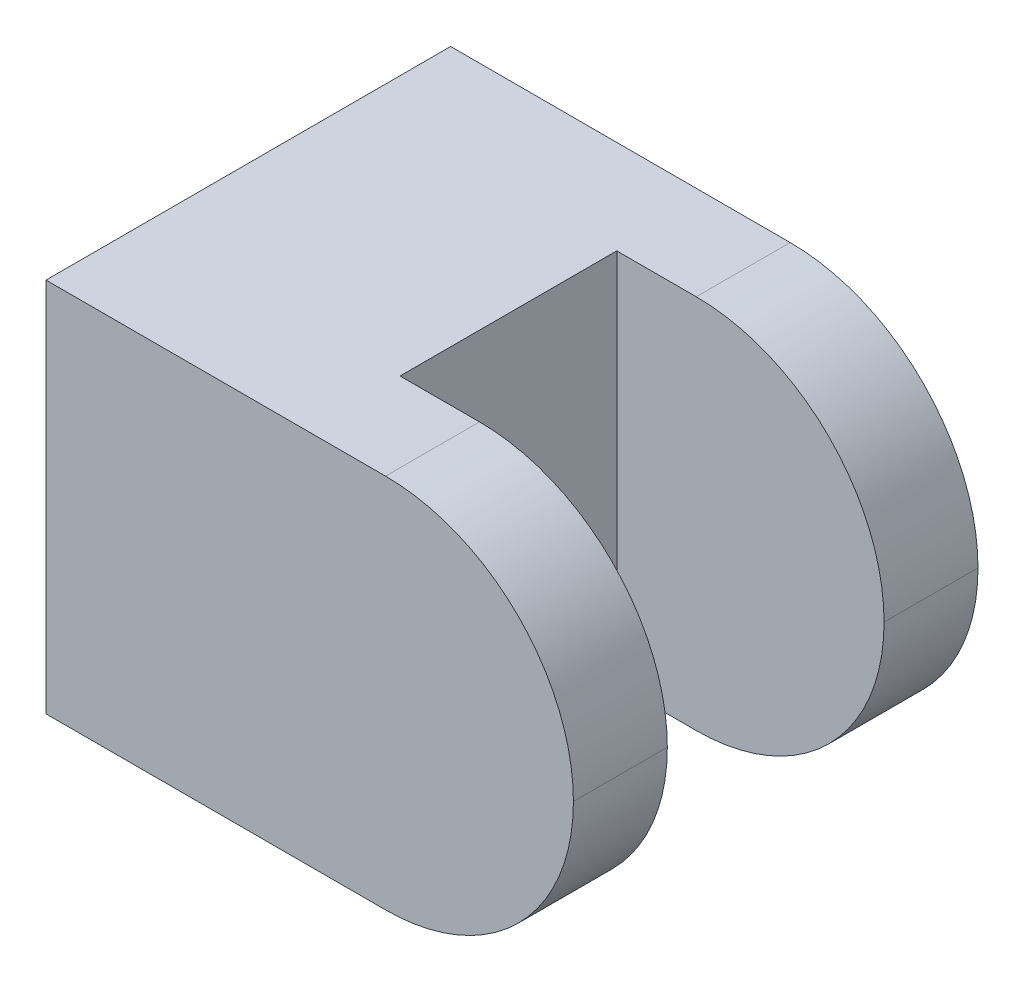
ISO-10303-21;
HEADER;
FILE_DESCRIPTION(('STEP AP214'),'2;1');
FILE_NAME('part.step','',(''),(''),'','','');
FILE_SCHEMA(('AUTOMOTIVE_DESIGN { 1 0 10303 214 1 1 1 1 }'));
ENDSEC;
DATA;
#1=APPLICATION_CONTEXT('core data for automotive mechanical design processes');
#2=APPLICATION_PROTOCOL_DEFINITION('international standard','automotive_design',2000,#1);
#3=PRODUCT_CONTEXT('',#1,'mechanical');
#4=PRODUCT('Part','Part','',(#3));
#5=PRODUCT_RELATED_PRODUCT_CATEGORY('part','',(#4));
#6=PRODUCT_DEFINITION_FORMATION('','',#4);
#7=PRODUCT_DEFINITION_CONTEXT('part definition',#1,'design');
#8=PRODUCT_DEFINITION('design','',#6,#7);
#9=PRODUCT_DEFINITION_SHAPE('','',#8);
#10=(LENGTH_UNIT() NAMED_UNIT(*) SI_UNIT(.MILLI.,.METRE.));
#11=(NAMED_UNIT(*) PLANE_ANGLE_UNIT() SI_UNIT($,.RADIAN.));
#12=(NAMED_UNIT(*) SI_UNIT($,.STERADIAN.) SOLID_ANGLE_UNIT());
#13=UNCERTAINTY_MEASURE_WITH_UNIT(LENGTH_MEASURE(1.E-05),#10,'distance_accuracy_value','');
#14=(GEOMETRIC_REPRESENTATION_CONTEXT(3) GLOBAL_UNCERTAINTY_ASSIGNED_CONTEXT((#13)) GLOBAL_UNIT_ASSIGNED_CONTEXT((#10,
#11,#12)) REPRESENTATION_CONTEXT('',''));
#15=CARTESIAN_POINT('',(0.,0.,0.));
#16=DIRECTION('',(0.,0.,1.));
#17=DIRECTION('',(1.,0.,0.));
#18=AXIS2_PLACEMENT_3D('',#15,#16,#17);
#19=CARTESIAN_POINT('',(0.,0.,56.));
#20=DIRECTION('',(1.,0.,0.));
#21=DIRECTION('',(0.,0.,-1.));
#22=AXIS2_PLACEMENT_3D('',#19,#20,#21);
#23=PLANE('',#22);
#24=DIRECTION('',(0.,-1.,0.));
#25=VECTOR('',#24,1.);
#26=CARTESIAN_POINT('',(0.,0.,0.));
#27=LINE('',#26,#25);
#28=CARTESIAN_POINT('',(0.,52.,0.));
#29=VERTEX_POINT('',#28);
#30=CARTESIAN_POINT('',(0.,0.,0.));
#31=VERTEX_POINT('',#30);
#32=EDGE_CURVE('E137',#29,#31,#27,.T.);
#33=ORIENTED_EDGE('',*,*,#32,.T.);
#34=DIRECTION('',(0.,0.,-1.));
#35=VECTOR('',#34,1.);
#36=CARTESIAN_POINT('',(0.,0.,56.));
#37=LINE('',#36,#35);
#38=CARTESIAN_POINT('',(0.,0.,56.));
#39=VERTEX_POINT('',#38);
#40=EDGE_CURVE('E156',#39,#31,#37,.T.);
#41=ORIENTED_EDGE('',*,*,#40,.F.);
#42=DIRECTION('',(0.,-1.,0.));
#43=VECTOR('',#42,1.);
#44=CARTESIAN_POINT('',(0.,0.,56.));
#45=LINE('',#44,#43);
#46=CARTESIAN_POINT('',(0.,52.,56.));
#47=VERTEX_POINT('',#46);
#48=EDGE_CURVE('E139',#47,#39,#45,.T.);
#49=ORIENTED_EDGE('',*,*,#48,.F.);
#50=DIRECTION('',(0.,0.,-1.));
#51=VECTOR('',#50,1.);
#52=CARTESIAN_POINT('',(0.,52.,56.));
#53=LINE('',#52,#51);
#54=EDGE_CURVE('E148',#47,#29,#53,.T.);
#55=ORIENTED_EDGE('',*,*,#54,.T.);
#56=EDGE_LOOP('',(#33,#41,#49,#55));
#57=FACE_BOUND('',#56,.T.);
#58=ADVANCED_FACE('F33',(#57),#23,.F.);
#59=CARTESIAN_POINT('',(0.,0.,56.));
#60=DIRECTION('',(0.,1.,0.));
#61=DIRECTION('',(0.,0.,1.));
#62=AXIS2_PLACEMENT_3D('',#59,#60,#61);
#63=PLANE('',#62);
#64=DIRECTION('',(1.,0.,0.));
#65=VECTOR('',#64,1.);
#66=CARTESIAN_POINT('',(0.,0.,0.));
#67=LINE('',#66,#65);
#68=CARTESIAN_POINT('',(47.,0.,0.));
#69=VERTEX_POINT('',#68);
#70=EDGE_CURVE('E151',#31,#69,#67,.T.);
#71=ORIENTED_EDGE('',*,*,#70,.T.);
#72=DIRECTION('',(0.,0.,-1.));
#73=VECTOR('',#72,1.);
#74=CARTESIAN_POINT('',(47.,0.,56.));
#75=LINE('',#74,#73);
#76=CARTESIAN_POINT('',(47.,0.,13.));
#77=VERTEX_POINT('',#76);
#78=EDGE_CURVE('E41',#69,#77,#75,.F.);
#79=ORIENTED_EDGE('',*,*,#78,.T.);
#80=DIRECTION('',(-1.,0.,0.));
#81=VECTOR('',#80,1.);
#82=CARTESIAN_POINT('',(73.,0.,13.));
#83=LINE('',#82,#81);
#84=CARTESIAN_POINT('',(36.,0.,13.));
#85=VERTEX_POINT('',#84);
#86=EDGE_CURVE('E106',#77,#85,#83,.T.);
#87=ORIENTED_EDGE('',*,*,#86,.T.);
#88=DIRECTION('',(0.,0.,1.));
#89=VECTOR('',#88,1.);
#90=CARTESIAN_POINT('',(36.,0.,13.));
#91=LINE('',#90,#89);
#92=CARTESIAN_POINT('',(36.,0.,43.));
#93=VERTEX_POINT('',#92);
#94=EDGE_CURVE('E111',#85,#93,#91,.T.);
#95=ORIENTED_EDGE('',*,*,#94,.T.);
#96=DIRECTION('',(1.,0.,0.));
#97=VECTOR('',#96,1.);
#98=CARTESIAN_POINT('',(73.,0.,43.));
#99=LINE('',#98,#97);
#100=CARTESIAN_POINT('',(47.,0.,43.));
#101=VERTEX_POINT('',#100);
#102=EDGE_CURVE('E125',#93,#101,#99,.T.);
#103=ORIENTED_EDGE('',*,*,#102,.T.);
#104=DIRECTION('',(0.,0.,-1.));
#105=VECTOR('',#104,1.);
#106=CARTESIAN_POINT('',(47.,0.,56.));
#107=LINE('',#106,#105);
#108=CARTESIAN_POINT('',(47.,0.,56.));
#109=VERTEX_POINT('',#108);
#110=EDGE_CURVE('E172',#101,#109,#107,.F.);
#111=ORIENTED_EDGE('',*,*,#110,.T.);
#112=DIRECTION('',(1.,0.,0.));
#113=VECTOR('',#112,1.);
#114=CARTESIAN_POINT('',(0.,0.,56.));
#115=LINE('',#114,#113);
#116=EDGE_CURVE('E142',#39,#109,#115,.T.);
#117=ORIENTED_EDGE('',*,*,#116,.F.);
#118=ORIENTED_EDGE('',*,*,#40,.T.);
#119=EDGE_LOOP('',(#71,#79,#87,#95,#103,#111,#117,#118));
#120=FACE_BOUND('',#119,.T.);
#121=ADVANCED_FACE('F108',(#120),#63,.F.);
#122=CARTESIAN_POINT('',(0.,52.,56.));
#123=DIRECTION('',(0.,-1.,0.));
#124=DIRECTION('',(0.,0.,-1.));
#125=AXIS2_PLACEMENT_3D('',#122,#123,#124);
#126=PLANE('',#125);
#127=DIRECTION('',(-1.,0.,0.));
#128=VECTOR('',#127,1.);
#129=CARTESIAN_POINT('',(73.,52.,13.));
#130=LINE('',#129,#128);
#131=CARTESIAN_POINT('',(47.,52.,13.));
#132=VERTEX_POINT('',#131);
#133=CARTESIAN_POINT('',(36.,52.,13.));
#134=VERTEX_POINT('',#133);
#135=EDGE_CURVE('E120',#132,#134,#130,.T.);
#136=ORIENTED_EDGE('',*,*,#135,.F.);
#137=DIRECTION('',(0.,0.,-1.));
#138=VECTOR('',#137,1.);
#139=CARTESIAN_POINT('',(47.,52.,56.));
#140=LINE('',#139,#138);
#141=CARTESIAN_POINT('',(47.,52.,0.));
#142=VERTEX_POINT('',#141);
#143=EDGE_CURVE('E176',#132,#142,#140,.T.);
#144=ORIENTED_EDGE('',*,*,#143,.T.);
#145=DIRECTION('',(-1.,0.,0.));
#146=VECTOR('',#145,1.);
#147=CARTESIAN_POINT('',(0.,52.,0.));
#148=LINE('',#147,#146);
#149=EDGE_CURVE('E143',#142,#29,#148,.T.);
#150=ORIENTED_EDGE('',*,*,#149,.T.);
#151=ORIENTED_EDGE('',*,*,#54,.F.);
#152=DIRECTION('',(-1.,0.,0.));
#153=VECTOR('',#152,1.);
#154=CARTESIAN_POINT('',(0.,52.,56.));
#155=LINE('',#154,#153);
#156=CARTESIAN_POINT('',(47.,52.,56.));
#157=VERTEX_POINT('',#156);
#158=EDGE_CURVE('E146',#157,#47,#155,.T.);
#159=ORIENTED_EDGE('',*,*,#158,.F.);
#160=DIRECTION('',(0.,0.,-1.));
#161=VECTOR('',#160,1.);
#162=CARTESIAN_POINT('',(47.,52.,56.));
#163=LINE('',#162,#161);
#164=CARTESIAN_POINT('',(47.,52.,43.));
#165=VERTEX_POINT('',#164);
#166=EDGE_CURVE('E159',#157,#165,#163,.T.);
#167=ORIENTED_EDGE('',*,*,#166,.T.);
#168=DIRECTION('',(1.,0.,0.));
#169=VECTOR('',#168,1.);
#170=CARTESIAN_POINT('',(73.,52.,43.));
#171=LINE('',#170,#169);
#172=CARTESIAN_POINT('',(36.,52.,43.));
#173=VERTEX_POINT('',#172);
#174=EDGE_CURVE('E114',#173,#165,#171,.T.);
#175=ORIENTED_EDGE('',*,*,#174,.F.);
#176=DIRECTION('',(0.,0.,1.));
#177=VECTOR('',#176,1.);
#178=CARTESIAN_POINT('',(36.,52.,13.));
#179=LINE('',#178,#177);
#180=EDGE_CURVE('E133',#134,#173,#179,.T.);
#181=ORIENTED_EDGE('',*,*,#180,.F.);
#182=EDGE_LOOP('',(#136,#144,#150,#151,#159,#167,#175,#181));
#183=FACE_BOUND('',#182,.T.);
#184=ADVANCED_FACE('F191',(#183),#126,.F.);
#185=CARTESIAN_POINT('',(0.,0.,56.));
#186=DIRECTION('',(0.,0.,-1.));
#187=DIRECTION('',(-1.,0.,0.));
#188=AXIS2_PLACEMENT_3D('',#185,#186,#187);
#189=PLANE('',#188);
#190=ORIENTED_EDGE('',*,*,#116,.T.);
#191=CARTESIAN_POINT('',(47.,26.,56.));
#192=DIRECTION('',(0.,0.,-1.));
#193=DIRECTION('',(-1.,0.,0.));
#194=AXIS2_PLACEMENT_3D('',#191,#192,#193);
#195=CIRCLE('',#194,26.);
#196=CARTESIAN_POINT('',(73.,26.,56.));
#197=VERTEX_POINT('',#196);
#198=EDGE_CURVE('E174',#109,#197,#195,.F.);
#199=ORIENTED_EDGE('',*,*,#198,.T.);
#200=CARTESIAN_POINT('',(47.,26.,56.));
#201=DIRECTION('',(0.,0.,-1.));
#202=DIRECTION('',(-1.,0.,0.));
#203=AXIS2_PLACEMENT_3D('',#200,#201,#202);
#204=CIRCLE('',#203,26.);
#205=EDGE_CURVE('E168',#197,#157,#204,.F.);
#206=ORIENTED_EDGE('',*,*,#205,.T.);
#207=ORIENTED_EDGE('',*,*,#158,.T.);
#208=ORIENTED_EDGE('',*,*,#48,.T.);
#209=EDGE_LOOP('',(#190,#199,#206,#207,#208));
#210=FACE_BOUND('',#209,.T.);
#211=ADVANCED_FACE('F203',(#210),#189,.F.);
#212=CARTESIAN_POINT('',(0.,0.,0.));
#213=DIRECTION('',(0.,0.,-1.));
#214=DIRECTION('',(-1.,0.,0.));
#215=AXIS2_PLACEMENT_3D('',#212,#213,#214);
#216=PLANE('',#215);
#217=CARTESIAN_POINT('',(47.,26.,0.));
#218=DIRECTION('',(0.,0.,-1.));
#219=DIRECTION('',(-1.,0.,0.));
#220=AXIS2_PLACEMENT_3D('',#217,#218,#219);
#221=CIRCLE('',#220,26.);
#222=CARTESIAN_POINT('',(73.,26.,0.));
#223=VERTEX_POINT('',#222);
#224=EDGE_CURVE('E179',#142,#223,#221,.T.);
#225=ORIENTED_EDGE('',*,*,#224,.T.);
#226=CARTESIAN_POINT('',(47.,26.,0.));
#227=DIRECTION('',(0.,0.,-1.));
#228=DIRECTION('',(-1.,0.,0.));
#229=AXIS2_PLACEMENT_3D('',#226,#227,#228);
#230=CIRCLE('',#229,26.);
#231=EDGE_CURVE('E55',#223,#69,#230,.T.);
#232=ORIENTED_EDGE('',*,*,#231,.T.);
#233=ORIENTED_EDGE('',*,*,#70,.F.);
#234=ORIENTED_EDGE('',*,*,#32,.F.);
#235=ORIENTED_EDGE('',*,*,#149,.F.);
#236=EDGE_LOOP('',(#225,#232,#233,#234,#235));
#237=FACE_BOUND('',#236,.T.);
#238=ADVANCED_FACE('F195',(#237),#216,.T.);
#239=CARTESIAN_POINT('',(73.,0.,43.));
#240=DIRECTION('',(0.,0.,1.));
#241=DIRECTION('',(1.,0.,0.));
#242=AXIS2_PLACEMENT_3D('',#239,#240,#241);
#243=PLANE('',#242);
#244=CARTESIAN_POINT('',(47.,26.,43.));
#245=DIRECTION('',(0.,0.,1.));
#246=DIRECTION('',(1.,0.,0.));
#247=AXIS2_PLACEMENT_3D('',#244,#245,#246);
#248=CIRCLE('',#247,26.);
#249=CARTESIAN_POINT('',(73.,26.,43.));
#250=VERTEX_POINT('',#249);
#251=EDGE_CURVE('E162',#165,#250,#248,.F.);
#252=ORIENTED_EDGE('',*,*,#251,.T.);
#253=CARTESIAN_POINT('',(47.,26.,43.));
#254=DIRECTION('',(0.,0.,1.));
#255=DIRECTION('',(1.,0.,0.));
#256=AXIS2_PLACEMENT_3D('',#253,#254,#255);
#257=CIRCLE('',#256,26.);
#258=EDGE_CURVE('E170',#250,#101,#257,.F.);
#259=ORIENTED_EDGE('',*,*,#258,.T.);
#260=ORIENTED_EDGE('',*,*,#102,.F.);
#261=DIRECTION('',(0.,1.,0.));
#262=VECTOR('',#261,1.);
#263=CARTESIAN_POINT('',(36.,0.,43.));
#264=LINE('',#263,#262);
#265=EDGE_CURVE('E124',#93,#173,#264,.T.);
#266=ORIENTED_EDGE('',*,*,#265,.T.);
#267=ORIENTED_EDGE('',*,*,#174,.T.);
#268=EDGE_LOOP('',(#252,#259,#260,#266,#267));
#269=FACE_BOUND('',#268,.T.);
#270=ADVANCED_FACE('F211',(#269),#243,.F.);
#271=CARTESIAN_POINT('',(36.,0.,13.));
#272=DIRECTION('',(-1.,0.,0.));
#273=DIRECTION('',(0.,0.,1.));
#274=AXIS2_PLACEMENT_3D('',#271,#272,#273);
#275=PLANE('',#274);
#276=ORIENTED_EDGE('',*,*,#180,.T.);
#277=ORIENTED_EDGE('',*,*,#265,.F.);
#278=ORIENTED_EDGE('',*,*,#94,.F.);
#279=DIRECTION('',(0.,1.,0.));
#280=VECTOR('',#279,1.);
#281=CARTESIAN_POINT('',(36.,0.,13.));
#282=LINE('',#281,#280);
#283=EDGE_CURVE('E117',#85,#134,#282,.T.);
#284=ORIENTED_EDGE('',*,*,#283,.T.);
#285=EDGE_LOOP('',(#276,#277,#278,#284));
#286=FACE_BOUND('',#285,.T.);
#287=ADVANCED_FACE('F127',(#286),#275,.F.);
#288=CARTESIAN_POINT('',(73.,0.,13.));
#289=DIRECTION('',(0.,0.,-1.));
#290=DIRECTION('',(-1.,0.,0.));
#291=AXIS2_PLACEMENT_3D('',#288,#289,#290);
#292=PLANE('',#291);
#293=ORIENTED_EDGE('',*,*,#86,.F.);
#294=CARTESIAN_POINT('',(47.,26.,13.));
#295=DIRECTION('',(0.,0.,-1.));
#296=DIRECTION('',(-1.,0.,0.));
#297=AXIS2_PLACEMENT_3D('',#294,#295,#296);
#298=CIRCLE('',#297,26.);
#299=CARTESIAN_POINT('',(73.,26.,13.));
#300=VERTEX_POINT('',#299);
#301=EDGE_CURVE('E11',#77,#300,#298,.F.);
#302=ORIENTED_EDGE('',*,*,#301,.T.);
#303=CARTESIAN_POINT('',(47.,26.,13.));
#304=DIRECTION('',(0.,0.,-1.));
#305=DIRECTION('',(-1.,0.,0.));
#306=AXIS2_PLACEMENT_3D('',#303,#304,#305);
#307=CIRCLE('',#306,26.);
#308=EDGE_CURVE('E184',#300,#132,#307,.F.);
#309=ORIENTED_EDGE('',*,*,#308,.T.);
#310=ORIENTED_EDGE('',*,*,#135,.T.);
#311=ORIENTED_EDGE('',*,*,#283,.F.);
#312=EDGE_LOOP('',(#293,#302,#309,#310,#311));
#313=FACE_BOUND('',#312,.T.);
#314=ADVANCED_FACE('F118',(#313),#292,.F.);
#315=CARTESIAN_POINT('',(47.,26.,56.));
#316=DIRECTION('',(0.,0.,-1.));
#317=DIRECTION('',(-1.,0.,0.));
#318=AXIS2_PLACEMENT_3D('',#315,#316,#317);
#319=CYLINDRICAL_SURFACE('',#318,26.);
#320=ORIENTED_EDGE('',*,*,#205,.F.);
#321=DIRECTION('',(0.,0.,-1.));
#322=VECTOR('',#321,1.);
#323=CARTESIAN_POINT('',(73.,26.,56.));
#324=LINE('',#323,#322);
#325=EDGE_CURVE('E165',#250,#197,#324,.F.);
#326=ORIENTED_EDGE('',*,*,#325,.F.);
#327=ORIENTED_EDGE('',*,*,#251,.F.);
#328=ORIENTED_EDGE('',*,*,#166,.F.);
#329=EDGE_LOOP('',(#320,#326,#327,#328));
#330=FACE_BOUND('',#329,.T.);
#331=ADVANCED_FACE('F208',(#330),#319,.T.);
#332=CARTESIAN_POINT('',(47.,26.,56.));
#333=DIRECTION('',(0.,0.,-1.));
#334=DIRECTION('',(-1.,0.,0.));
#335=AXIS2_PLACEMENT_3D('',#332,#333,#334);
#336=CYLINDRICAL_SURFACE('',#335,26.);
#337=ORIENTED_EDGE('',*,*,#198,.F.);
#338=ORIENTED_EDGE('',*,*,#110,.F.);
#339=ORIENTED_EDGE('',*,*,#258,.F.);
#340=ORIENTED_EDGE('',*,*,#325,.T.);
#341=EDGE_LOOP('',(#337,#338,#339,#340));
#342=FACE_BOUND('',#341,.T.);
#343=ADVANCED_FACE('F214',(#342),#336,.T.);
#344=CARTESIAN_POINT('',(47.,26.,56.));
#345=DIRECTION('',(0.,0.,-1.));
#346=DIRECTION('',(-1.,0.,0.));
#347=AXIS2_PLACEMENT_3D('',#344,#345,#346);
#348=CYLINDRICAL_SURFACE('',#347,26.);
#349=ORIENTED_EDGE('',*,*,#308,.F.);
#350=DIRECTION('',(0.,0.,-1.));
#351=VECTOR('',#350,1.);
#352=CARTESIAN_POINT('',(73.,26.,56.));
#353=LINE('',#352,#351);
#354=EDGE_CURVE('E181',#223,#300,#353,.F.);
#355=ORIENTED_EDGE('',*,*,#354,.F.);
#356=ORIENTED_EDGE('',*,*,#224,.F.);
#357=ORIENTED_EDGE('',*,*,#143,.F.);
#358=EDGE_LOOP('',(#349,#355,#356,#357));
#359=FACE_BOUND('',#358,.T.);
#360=ADVANCED_FACE('F194',(#359),#348,.T.);
#361=CARTESIAN_POINT('',(47.,26.,56.));
#362=DIRECTION('',(0.,0.,-1.));
#363=DIRECTION('',(-1.,0.,0.));
#364=AXIS2_PLACEMENT_3D('',#361,#362,#363);
#365=CYLINDRICAL_SURFACE('',#364,26.);
#366=ORIENTED_EDGE('',*,*,#301,.F.);
#367=ORIENTED_EDGE('',*,*,#78,.F.);
#368=ORIENTED_EDGE('',*,*,#231,.F.);
#369=ORIENTED_EDGE('',*,*,#354,.T.);
#370=EDGE_LOOP('',(#366,#367,#368,#369));
#371=FACE_BOUND('',#370,.T.);
#372=ADVANCED_FACE('F35',(#371),#365,.T.);
#373=CLOSED_SHELL('',(#58,#121,#184,#211,#238,#270,#287,#314,#331,#343,#360,#372));
#374=MANIFOLD_SOLID_BREP('B2',#373);
#375=ADVANCED_BREP_SHAPE_REPRESENTATION('',(#18,#374),#14);
#376=SHAPE_DEFINITION_REPRESENTATION(#9,#375);
ENDSEC;
END-ISO-10303-21;
